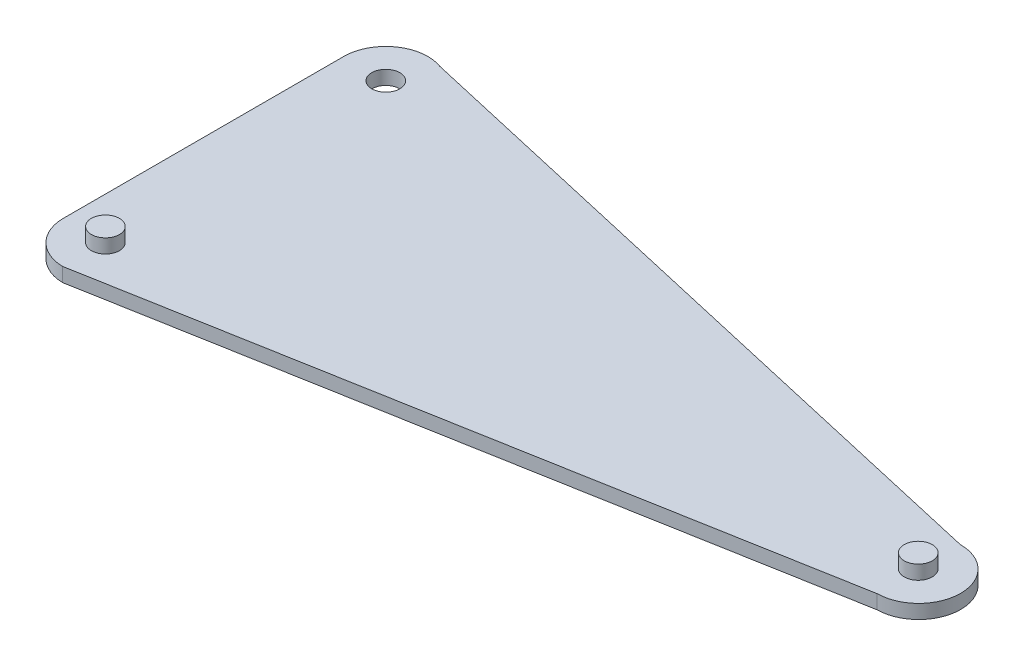
ISO-10303-21;
HEADER;
FILE_DESCRIPTION(('STEP AP214'),'2;1');
FILE_NAME('part.step','',(''),(''),'','','');
FILE_SCHEMA(('AUTOMOTIVE_DESIGN { 1 0 10303 214 1 1 1 1 }'));
ENDSEC;
DATA;
#1=APPLICATION_CONTEXT('core data for automotive mechanical design processes');
#2=APPLICATION_PROTOCOL_DEFINITION('international standard','automotive_design',2000,#1);
#3=PRODUCT_CONTEXT('',#1,'mechanical');
#4=PRODUCT('Part','Part','',(#3));
#5=PRODUCT_RELATED_PRODUCT_CATEGORY('part','',(#4));
#6=PRODUCT_DEFINITION_FORMATION('','',#4);
#7=PRODUCT_DEFINITION_CONTEXT('part definition',#1,'design');
#8=PRODUCT_DEFINITION('design','',#6,#7);
#9=PRODUCT_DEFINITION_SHAPE('','',#8);
#10=(LENGTH_UNIT() NAMED_UNIT(*) SI_UNIT(.MILLI.,.METRE.));
#11=(NAMED_UNIT(*) PLANE_ANGLE_UNIT() SI_UNIT($,.RADIAN.));
#12=(NAMED_UNIT(*) SI_UNIT($,.STERADIAN.) SOLID_ANGLE_UNIT());
#13=UNCERTAINTY_MEASURE_WITH_UNIT(LENGTH_MEASURE(1.E-05),#10,'distance_accuracy_value','');
#14=(GEOMETRIC_REPRESENTATION_CONTEXT(3) GLOBAL_UNCERTAINTY_ASSIGNED_CONTEXT((#13)) GLOBAL_UNIT_ASSIGNED_CONTEXT((#10,
#11,#12)) REPRESENTATION_CONTEXT('',''));
#15=CARTESIAN_POINT('',(0.,0.,0.));
#16=DIRECTION('',(0.,0.,1.));
#17=DIRECTION('',(1.,0.,0.));
#18=AXIS2_PLACEMENT_3D('',#15,#16,#17);
#19=CARTESIAN_POINT('',(4.46256038726198,1.,0.));
#20=DIRECTION('',(0.,-1.,0.));
#21=DIRECTION('',(0.,0.,-1.));
#22=AXIS2_PLACEMENT_3D('',#19,#20,#21);
#23=CYLINDRICAL_SURFACE('',#22,1.);
#24=CARTESIAN_POINT('',(4.46256038726198,0.,0.));
#25=DIRECTION('',(0.,1.,0.));
#26=DIRECTION('',(0.,0.,1.));
#27=AXIS2_PLACEMENT_3D('',#24,#25,#26);
#28=CIRCLE('',#27,1.);
#29=CARTESIAN_POINT('',(4.46256038726198,0.,1.));
#30=VERTEX_POINT('',#29);
#31=EDGE_CURVE('E282',#30,#30,#28,.T.);
#32=ORIENTED_EDGE('',*,*,#31,.F.);
#33=EDGE_LOOP('',(#32));
#34=FACE_BOUND('',#33,.T.);
#35=CARTESIAN_POINT('',(4.46256038726198,0.5,0.));
#36=DIRECTION('',(0.,1.,0.));
#37=DIRECTION('',(0.,0.,1.));
#38=AXIS2_PLACEMENT_3D('',#35,#36,#37);
#39=CIRCLE('',#38,1.);
#40=CARTESIAN_POINT('',(4.46256038726198,0.5,1.));
#41=VERTEX_POINT('',#40);
#42=EDGE_CURVE('E274',#41,#41,#39,.T.);
#43=ORIENTED_EDGE('',*,*,#42,.T.);
#44=EDGE_LOOP('',(#43));
#45=FACE_BOUND('',#44,.T.);
#46=ADVANCED_FACE('F38',(#34,#45),#23,.F.);
#47=CARTESIAN_POINT('',(-44.6828800545384,1.,-11.1642246316802));
#48=DIRECTION('',(0.,1.,0.));
#49=DIRECTION('',(0.,0.,1.));
#50=AXIS2_PLACEMENT_3D('',#47,#48,#49);
#51=PLANE('',#50);
#52=CARTESIAN_POINT('',(4.46256038726198,1.,0.));
#53=DIRECTION('',(0.,1.,0.));
#54=DIRECTION('',(0.,0.,1.));
#55=AXIS2_PLACEMENT_3D('',#52,#53,#54);
#56=CIRCLE('',#55,1.);
#57=CARTESIAN_POINT('',(4.46256038726198,1.,1.));
#58=VERTEX_POINT('',#57);
#59=EDGE_CURVE('E283',#58,#58,#56,.T.);
#60=ORIENTED_EDGE('',*,*,#59,.F.);
#61=EDGE_LOOP('',(#60));
#62=FACE_BOUND('',#61,.T.);
#63=CARTESIAN_POINT('',(-44.6828800545384,1.,-11.1642246316802));
#64=DIRECTION('',(0.,1.,0.));
#65=DIRECTION('',(0.,0.,1.));
#66=AXIS2_PLACEMENT_3D('',#63,#64,#65);
#67=CIRCLE('',#66,3.);
#68=CARTESIAN_POINT('',(-43.6575830945841,1.,-13.9835802573345));
#69=VERTEX_POINT('',#68);
#70=CARTESIAN_POINT('',(-47.6828800545384,1.,-11.1642246316802));
#71=VERTEX_POINT('',#70);
#72=EDGE_CURVE('E135',#69,#71,#67,.T.);
#73=ORIENTED_EDGE('',*,*,#72,.T.);
#74=DIRECTION('',(0.,0.,1.));
#75=VECTOR('',#74,1.);
#76=CARTESIAN_POINT('',(-47.6828800545384,1.,-11.1642246316802));
#77=LINE('',#76,#75);
#78=CARTESIAN_POINT('',(-47.6828800545384,1.,8.83577536831982));
#79=VERTEX_POINT('',#78);
#80=EDGE_CURVE('E92',#71,#79,#77,.T.);
#81=ORIENTED_EDGE('',*,*,#80,.T.);
#82=CARTESIAN_POINT('',(-44.6828800545384,1.,8.83577536831982));
#83=DIRECTION('',(0.,1.,0.));
#84=DIRECTION('',(0.,0.,-1.));
#85=AXIS2_PLACEMENT_3D('',#82,#83,#84);
#86=CIRCLE('',#85,3.);
#87=CARTESIAN_POINT('',(-44.7526191470283,1.,11.8349646686106));
#88=VERTEX_POINT('',#87);
#89=EDGE_CURVE('E106',#79,#88,#86,.T.);
#90=ORIENTED_EDGE('',*,*,#89,.T.);
#91=DIRECTION('',(0.984295975568269,0.,-0.176526010774927));
#92=VECTOR('',#91,1.);
#93=CARTESIAN_POINT('',(-44.7526191470283,1.,11.8349646686106));
#94=LINE('',#93,#92);
#95=CARTESIAN_POINT('',(4.51283967309183,1.,2.99957863597813));
#96=VERTEX_POINT('',#95);
#97=EDGE_CURVE('E99',#88,#96,#94,.T.);
#98=ORIENTED_EDGE('',*,*,#97,.T.);
#99=CARTESIAN_POINT('',(4.4877000301769,1.,-0.000210682010933472));
#100=DIRECTION('',(0.,1.,0.));
#101=DIRECTION('',(0.,0.,-1.));
#102=AXIS2_PLACEMENT_3D('',#99,#100,#101);
#103=CIRCLE('',#102,2.99989465714501);
#104=CARTESIAN_POINT('',(4.46256038726198,1.,-3.));
#105=VERTEX_POINT('',#104);
#106=EDGE_CURVE('E104',#96,#105,#103,.T.);
#107=ORIENTED_EDGE('',*,*,#106,.T.);
#108=DIRECTION('',(-0.974925839666068,0.,-0.222530014046223));
#109=VECTOR('',#108,1.);
#110=CARTESIAN_POINT('',(-43.6575830945841,1.,-13.9835802573345));
#111=LINE('',#110,#109);
#112=EDGE_CURVE('E55',#105,#69,#111,.T.);
#113=ORIENTED_EDGE('',*,*,#112,.T.);
#114=EDGE_LOOP('',(#73,#81,#90,#98,#107,#113));
#115=FACE_BOUND('',#114,.T.);
#116=CARTESIAN_POINT('',(-44.6828800545384,1.,-11.1642246316802));
#117=DIRECTION('',(0.,1.,0.));
#118=DIRECTION('',(0.,0.,1.));
#119=AXIS2_PLACEMENT_3D('',#116,#117,#118);
#120=CIRCLE('',#119,0.999999999999998);
#121=CARTESIAN_POINT('',(-44.6828800545384,1.,-10.1642246316802));
#122=VERTEX_POINT('',#121);
#123=EDGE_CURVE('E128',#122,#122,#120,.T.);
#124=ORIENTED_EDGE('',*,*,#123,.F.);
#125=EDGE_LOOP('',(#124));
#126=FACE_BOUND('',#125,.T.);
#127=CARTESIAN_POINT('',(-44.6828800545384,1.,8.83577536831982));
#128=DIRECTION('',(0.,1.,0.));
#129=DIRECTION('',(0.,0.,1.));
#130=AXIS2_PLACEMENT_3D('',#127,#128,#129);
#131=CIRCLE('',#130,0.999999999999998);
#132=CARTESIAN_POINT('',(-44.6828800545384,1.,9.83577536831982));
#133=VERTEX_POINT('',#132);
#134=EDGE_CURVE('E279',#133,#133,#131,.T.);
#135=ORIENTED_EDGE('',*,*,#134,.F.);
#136=EDGE_LOOP('',(#135));
#137=FACE_BOUND('',#136,.T.);
#138=ADVANCED_FACE('F101',(#62,#115,#126,#137),#51,.T.);
#139=CARTESIAN_POINT('',(-44.6828800545384,0.,-11.1642246316802));
#140=DIRECTION('',(0.,1.,0.));
#141=DIRECTION('',(0.,0.,1.));
#142=AXIS2_PLACEMENT_3D('',#139,#140,#141);
#143=PLANE('',#142);
#144=CARTESIAN_POINT('',(-44.6828800545384,0.,-11.1642246316802));
#145=DIRECTION('',(0.,1.,0.));
#146=DIRECTION('',(0.,0.,1.));
#147=AXIS2_PLACEMENT_3D('',#144,#145,#146);
#148=CIRCLE('',#147,3.);
#149=CARTESIAN_POINT('',(-43.6575830945841,0.,-13.9835802573345));
#150=VERTEX_POINT('',#149);
#151=CARTESIAN_POINT('',(-47.6828800545384,0.,-11.1642246316802));
#152=VERTEX_POINT('',#151);
#153=EDGE_CURVE('E124',#150,#152,#148,.T.);
#154=ORIENTED_EDGE('',*,*,#153,.F.);
#155=DIRECTION('',(-0.974925839666068,0.,-0.222530014046223));
#156=VECTOR('',#155,1.);
#157=CARTESIAN_POINT('',(-43.6575830945841,0.,-13.9835802573345));
#158=LINE('',#157,#156);
#159=CARTESIAN_POINT('',(4.46256038726198,0.,-3.));
#160=VERTEX_POINT('',#159);
#161=EDGE_CURVE('E84',#160,#150,#158,.T.);
#162=ORIENTED_EDGE('',*,*,#161,.F.);
#163=CARTESIAN_POINT('',(4.4877000301769,0.,-0.000210682010933472));
#164=DIRECTION('',(0.,1.,0.));
#165=DIRECTION('',(0.,0.,-1.));
#166=AXIS2_PLACEMENT_3D('',#163,#164,#165);
#167=CIRCLE('',#166,2.99989465714501);
#168=CARTESIAN_POINT('',(4.51283967309183,0.,2.99957863597813));
#169=VERTEX_POINT('',#168);
#170=EDGE_CURVE('E78',#169,#160,#167,.T.);
#171=ORIENTED_EDGE('',*,*,#170,.F.);
#172=DIRECTION('',(0.984295975568269,0.,-0.176526010774927));
#173=VECTOR('',#172,1.);
#174=CARTESIAN_POINT('',(-44.7526191470283,0.,11.8349646686106));
#175=LINE('',#174,#173);
#176=CARTESIAN_POINT('',(-44.7526191470283,0.,11.8349646686106));
#177=VERTEX_POINT('',#176);
#178=EDGE_CURVE('E114',#177,#169,#175,.T.);
#179=ORIENTED_EDGE('',*,*,#178,.F.);
#180=CARTESIAN_POINT('',(-44.6828800545384,0.,8.83577536831982));
#181=DIRECTION('',(0.,1.,0.));
#182=DIRECTION('',(0.,0.,-1.));
#183=AXIS2_PLACEMENT_3D('',#180,#181,#182);
#184=CIRCLE('',#183,3.);
#185=CARTESIAN_POINT('',(-47.6828800545384,0.,8.83577536831982));
#186=VERTEX_POINT('',#185);
#187=EDGE_CURVE('E130',#186,#177,#184,.T.);
#188=ORIENTED_EDGE('',*,*,#187,.F.);
#189=DIRECTION('',(0.,0.,1.));
#190=VECTOR('',#189,1.);
#191=CARTESIAN_POINT('',(-47.6828800545384,0.,-11.1642246316802));
#192=LINE('',#191,#190);
#193=EDGE_CURVE('E127',#152,#186,#192,.T.);
#194=ORIENTED_EDGE('',*,*,#193,.F.);
#195=EDGE_LOOP('',(#154,#162,#171,#179,#188,#194));
#196=FACE_BOUND('',#195,.T.);
#197=CARTESIAN_POINT('',(-44.6828800545384,0.,-11.1642246316802));
#198=DIRECTION('',(0.,1.,0.));
#199=DIRECTION('',(0.,0.,1.));
#200=AXIS2_PLACEMENT_3D('',#197,#198,#199);
#201=CIRCLE('',#200,0.999999999999998);
#202=CARTESIAN_POINT('',(-44.6828800545384,0.,-10.1642246316802));
#203=VERTEX_POINT('',#202);
#204=EDGE_CURVE('E286',#203,#203,#201,.T.);
#205=ORIENTED_EDGE('',*,*,#204,.T.);
#206=EDGE_LOOP('',(#205));
#207=FACE_BOUND('',#206,.T.);
#208=ORIENTED_EDGE('',*,*,#31,.T.);
#209=EDGE_LOOP('',(#208));
#210=FACE_BOUND('',#209,.T.);
#211=ADVANCED_FACE('F144',(#196,#207,#210),#143,.F.);
#212=CARTESIAN_POINT('',(-44.6828800545384,1.,-11.1642246316802));
#213=DIRECTION('',(0.,-1.,0.));
#214=DIRECTION('',(0.,0.,-1.));
#215=AXIS2_PLACEMENT_3D('',#212,#213,#214);
#216=CYLINDRICAL_SURFACE('',#215,3.);
#217=ORIENTED_EDGE('',*,*,#153,.T.);
#218=DIRECTION('',(0.,-1.,0.));
#219=VECTOR('',#218,1.);
#220=CARTESIAN_POINT('',(-47.6828800545384,1.,-11.1642246316802));
#221=LINE('',#220,#219);
#222=EDGE_CURVE('E11',#71,#152,#221,.T.);
#223=ORIENTED_EDGE('',*,*,#222,.F.);
#224=ORIENTED_EDGE('',*,*,#72,.F.);
#225=DIRECTION('',(0.,-1.,0.));
#226=VECTOR('',#225,1.);
#227=CARTESIAN_POINT('',(-43.6575830945841,1.,-13.9835802573345));
#228=LINE('',#227,#226);
#229=EDGE_CURVE('E120',#69,#150,#228,.T.);
#230=ORIENTED_EDGE('',*,*,#229,.T.);
#231=EDGE_LOOP('',(#217,#223,#224,#230));
#232=FACE_BOUND('',#231,.T.);
#233=ADVANCED_FACE('F40',(#232),#216,.T.);
#234=CARTESIAN_POINT('',(-47.6828800545384,1.,-11.1642246316802));
#235=DIRECTION('',(1.,0.,0.));
#236=DIRECTION('',(0.,0.,-1.));
#237=AXIS2_PLACEMENT_3D('',#234,#235,#236);
#238=PLANE('',#237);
#239=ORIENTED_EDGE('',*,*,#193,.T.);
#240=DIRECTION('',(0.,-1.,0.));
#241=VECTOR('',#240,1.);
#242=CARTESIAN_POINT('',(-47.6828800545384,1.,8.83577536831982));
#243=LINE('',#242,#241);
#244=EDGE_CURVE('E47',#79,#186,#243,.T.);
#245=ORIENTED_EDGE('',*,*,#244,.F.);
#246=ORIENTED_EDGE('',*,*,#80,.F.);
#247=ORIENTED_EDGE('',*,*,#222,.T.);
#248=EDGE_LOOP('',(#239,#245,#246,#247));
#249=FACE_BOUND('',#248,.T.);
#250=ADVANCED_FACE('F181',(#249),#238,.F.);
#251=CARTESIAN_POINT('',(-44.6828800545384,1.,8.83577536831982));
#252=DIRECTION('',(0.,-1.,0.));
#253=DIRECTION('',(0.,0.,-1.));
#254=AXIS2_PLACEMENT_3D('',#251,#252,#253);
#255=CYLINDRICAL_SURFACE('',#254,3.);
#256=ORIENTED_EDGE('',*,*,#187,.T.);
#257=DIRECTION('',(0.,-1.,0.));
#258=VECTOR('',#257,1.);
#259=CARTESIAN_POINT('',(-44.7526191470283,1.,11.8349646686106));
#260=LINE('',#259,#258);
#261=EDGE_CURVE('E115',#88,#177,#260,.T.);
#262=ORIENTED_EDGE('',*,*,#261,.F.);
#263=ORIENTED_EDGE('',*,*,#89,.F.);
#264=ORIENTED_EDGE('',*,*,#244,.T.);
#265=EDGE_LOOP('',(#256,#262,#263,#264));
#266=FACE_BOUND('',#265,.T.);
#267=ADVANCED_FACE('F141',(#266),#255,.T.);
#268=CARTESIAN_POINT('',(-44.7526191470283,1.,11.8349646686106));
#269=DIRECTION('',(-0.176526010774927,0.,-0.984295975568269));
#270=DIRECTION('',(-0.984295975568269,0.,0.176526010774927));
#271=AXIS2_PLACEMENT_3D('',#268,#269,#270);
#272=PLANE('',#271);
#273=ORIENTED_EDGE('',*,*,#178,.T.);
#274=DIRECTION('',(0.,-1.,0.));
#275=VECTOR('',#274,1.);
#276=CARTESIAN_POINT('',(4.51283967309183,1.,2.99957863597813));
#277=LINE('',#276,#275);
#278=EDGE_CURVE('E111',#96,#169,#277,.T.);
#279=ORIENTED_EDGE('',*,*,#278,.F.);
#280=ORIENTED_EDGE('',*,*,#97,.F.);
#281=ORIENTED_EDGE('',*,*,#261,.T.);
#282=EDGE_LOOP('',(#273,#279,#280,#281));
#283=FACE_BOUND('',#282,.T.);
#284=ADVANCED_FACE('F112',(#283),#272,.F.);
#285=CARTESIAN_POINT('',(4.4877000301769,1.,-0.000210682010933472));
#286=DIRECTION('',(0.,-1.,0.));
#287=DIRECTION('',(0.,0.,-1.));
#288=AXIS2_PLACEMENT_3D('',#285,#286,#287);
#289=CYLINDRICAL_SURFACE('',#288,2.99989465714501);
#290=ORIENTED_EDGE('',*,*,#170,.T.);
#291=DIRECTION('',(0.,-1.,0.));
#292=VECTOR('',#291,1.);
#293=CARTESIAN_POINT('',(4.46256038726198,1.,-3.));
#294=LINE('',#293,#292);
#295=EDGE_CURVE('E116',#105,#160,#294,.T.);
#296=ORIENTED_EDGE('',*,*,#295,.F.);
#297=ORIENTED_EDGE('',*,*,#106,.F.);
#298=ORIENTED_EDGE('',*,*,#278,.T.);
#299=EDGE_LOOP('',(#290,#296,#297,#298));
#300=FACE_BOUND('',#299,.T.);
#301=ADVANCED_FACE('F118',(#300),#289,.T.);
#302=CARTESIAN_POINT('',(-43.6575830945841,1.,-13.9835802573345));
#303=DIRECTION('',(-0.222530014046223,0.,0.974925839666068));
#304=DIRECTION('',(0.974925839666068,0.,0.222530014046223));
#305=AXIS2_PLACEMENT_3D('',#302,#303,#304);
#306=PLANE('',#305);
#307=ORIENTED_EDGE('',*,*,#161,.T.);
#308=ORIENTED_EDGE('',*,*,#229,.F.);
#309=ORIENTED_EDGE('',*,*,#112,.F.);
#310=ORIENTED_EDGE('',*,*,#295,.T.);
#311=EDGE_LOOP('',(#307,#308,#309,#310));
#312=FACE_BOUND('',#311,.T.);
#313=ADVANCED_FACE('F149',(#312),#306,.F.);
#314=CARTESIAN_POINT('',(-44.6828800545384,1.,-11.1642246316802));
#315=DIRECTION('',(0.,-1.,0.));
#316=DIRECTION('',(0.,0.,-1.));
#317=AXIS2_PLACEMENT_3D('',#314,#315,#316);
#318=CYLINDRICAL_SURFACE('',#317,0.999999999999998);
#319=ORIENTED_EDGE('',*,*,#123,.T.);
#320=EDGE_LOOP('',(#319));
#321=FACE_BOUND('',#320,.T.);
#322=ORIENTED_EDGE('',*,*,#204,.F.);
#323=EDGE_LOOP('',(#322));
#324=FACE_BOUND('',#323,.T.);
#325=ADVANCED_FACE('F151',(#321,#324),#318,.F.);
#326=CARTESIAN_POINT('',(4.46256038726198,0.5,0.));
#327=DIRECTION('',(0.,1.,0.));
#328=DIRECTION('',(0.,0.,1.));
#329=AXIS2_PLACEMENT_3D('',#326,#327,#328);
#330=PLANE('',#329);
#331=ORIENTED_EDGE('',*,*,#42,.F.);
#332=EDGE_LOOP('',(#331));
#333=FACE_BOUND('',#332,.T.);
#334=ADVANCED_FACE('F157',(#333),#330,.F.);
#335=CARTESIAN_POINT('',(4.46256038726198,1.5,0.));
#336=DIRECTION('',(0.,-1.,0.));
#337=DIRECTION('',(0.,0.,-1.));
#338=AXIS2_PLACEMENT_3D('',#335,#336,#337);
#339=CYLINDRICAL_SURFACE('',#338,1.);
#340=ORIENTED_EDGE('',*,*,#59,.T.);
#341=EDGE_LOOP('',(#340));
#342=FACE_BOUND('',#341,.T.);
#343=CARTESIAN_POINT('',(4.46256038726198,2.,0.));
#344=DIRECTION('',(0.,1.,0.));
#345=DIRECTION('',(0.,0.,1.));
#346=AXIS2_PLACEMENT_3D('',#343,#344,#345);
#347=CIRCLE('',#346,1.);
#348=CARTESIAN_POINT('',(4.46256038726198,2.,1.));
#349=VERTEX_POINT('',#348);
#350=EDGE_CURVE('E271',#349,#349,#347,.T.);
#351=ORIENTED_EDGE('',*,*,#350,.F.);
#352=EDGE_LOOP('',(#351));
#353=FACE_BOUND('',#352,.T.);
#354=ADVANCED_FACE('F173',(#342,#353),#339,.T.);
#355=CARTESIAN_POINT('',(4.46256038726198,2.,0.));
#356=DIRECTION('',(0.,1.,0.));
#357=DIRECTION('',(0.,0.,1.));
#358=AXIS2_PLACEMENT_3D('',#355,#356,#357);
#359=PLANE('',#358);
#360=ORIENTED_EDGE('',*,*,#350,.T.);
#361=EDGE_LOOP('',(#360));
#362=FACE_BOUND('',#361,.T.);
#363=ADVANCED_FACE('F231',(#362),#359,.T.);
#364=CARTESIAN_POINT('',(-44.6828800545384,2.,8.83577536831982));
#365=DIRECTION('',(0.,-1.,0.));
#366=DIRECTION('',(0.,0.,-1.));
#367=AXIS2_PLACEMENT_3D('',#364,#365,#366);
#368=CYLINDRICAL_SURFACE('',#367,0.999999999999998);
#369=ORIENTED_EDGE('',*,*,#134,.T.);
#370=EDGE_LOOP('',(#369));
#371=FACE_BOUND('',#370,.T.);
#372=CARTESIAN_POINT('',(-44.6828800545384,2.,8.83577536831982));
#373=DIRECTION('',(0.,1.,0.));
#374=DIRECTION('',(0.,0.,1.));
#375=AXIS2_PLACEMENT_3D('',#372,#373,#374);
#376=CIRCLE('',#375,0.999999999999998);
#377=CARTESIAN_POINT('',(-44.6828800545384,2.,9.83577536831982));
#378=VERTEX_POINT('',#377);
#379=EDGE_CURVE('E269',#378,#378,#376,.T.);
#380=ORIENTED_EDGE('',*,*,#379,.F.);
#381=EDGE_LOOP('',(#380));
#382=FACE_BOUND('',#381,.T.);
#383=ADVANCED_FACE('F238',(#371,#382),#368,.T.);
#384=CARTESIAN_POINT('',(-44.6828800545384,2.,8.83577536831982));
#385=DIRECTION('',(0.,1.,0.));
#386=DIRECTION('',(0.,0.,1.));
#387=AXIS2_PLACEMENT_3D('',#384,#385,#386);
#388=PLANE('',#387);
#389=ORIENTED_EDGE('',*,*,#379,.T.);
#390=EDGE_LOOP('',(#389));
#391=FACE_BOUND('',#390,.T.);
#392=ADVANCED_FACE('F253',(#391),#388,.T.);
#393=CLOSED_SHELL('',(#46,#138,#211,#233,#250,#267,#284,#301,#313,#325,#334,#354,#363,#383,#392));
#394=MANIFOLD_SOLID_BREP('B2',#393);
#395=ADVANCED_BREP_SHAPE_REPRESENTATION('',(#18,#394),#14);
#396=SHAPE_DEFINITION_REPRESENTATION(#9,#395);
ENDSEC;
END-ISO-10303-21;
